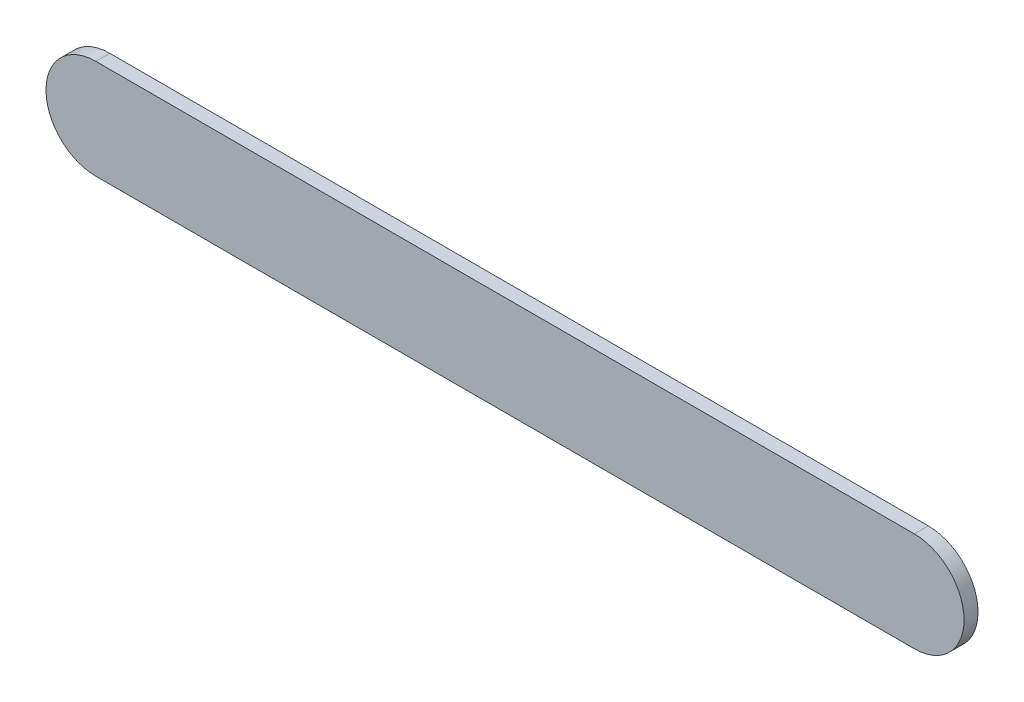
ISO-10303-21;
HEADER;
FILE_DESCRIPTION(('STEP AP214'),'2;1');
FILE_NAME('part.step','',(''),(''),'','','');
FILE_SCHEMA(('AUTOMOTIVE_DESIGN { 1 0 10303 214 1 1 1 1 }'));
ENDSEC;
DATA;
#1=APPLICATION_CONTEXT('core data for automotive mechanical design processes');
#2=APPLICATION_PROTOCOL_DEFINITION('international standard','automotive_design',2000,#1);
#3=PRODUCT_CONTEXT('',#1,'mechanical');
#4=PRODUCT('Part','Part','',(#3));
#5=PRODUCT_RELATED_PRODUCT_CATEGORY('part','',(#4));
#6=PRODUCT_DEFINITION_FORMATION('','',#4);
#7=PRODUCT_DEFINITION_CONTEXT('part definition',#1,'design');
#8=PRODUCT_DEFINITION('design','',#6,#7);
#9=PRODUCT_DEFINITION_SHAPE('','',#8);
#10=(LENGTH_UNIT() NAMED_UNIT(*) SI_UNIT(.MILLI.,.METRE.));
#11=(NAMED_UNIT(*) PLANE_ANGLE_UNIT() SI_UNIT($,.RADIAN.));
#12=(NAMED_UNIT(*) SI_UNIT($,.STERADIAN.) SOLID_ANGLE_UNIT());
#13=UNCERTAINTY_MEASURE_WITH_UNIT(LENGTH_MEASURE(1.E-05),#10,'distance_accuracy_value','');
#14=(GEOMETRIC_REPRESENTATION_CONTEXT(3) GLOBAL_UNCERTAINTY_ASSIGNED_CONTEXT((#13)) GLOBAL_UNIT_ASSIGNED_CONTEXT((#10,
#11,#12)) REPRESENTATION_CONTEXT('',''));
#15=CARTESIAN_POINT('',(0.,0.,0.));
#16=DIRECTION('',(0.,0.,1.));
#17=DIRECTION('',(1.,0.,0.));
#18=AXIS2_PLACEMENT_3D('',#15,#16,#17);
#19=CARTESIAN_POINT('',(93.417009,92.5599368,0.));
#20=DIRECTION('',(0.,1.,0.));
#21=DIRECTION('',(1.,0.,0.));
#22=AXIS2_PLACEMENT_3D('',#19,#20,#21);
#23=PLANE('',#22);
#24=DIRECTION('',(1.,0.,0.));
#25=VECTOR('',#24,1.);
#26=CARTESIAN_POINT('',(93.417009,92.5599368,0.03556));
#27=LINE('',#26,#25);
#28=CARTESIAN_POINT('',(93.417009,92.5599368,0.03556));
#29=VERTEX_POINT('',#28);
#30=CARTESIAN_POINT('',(95.5069464,92.5599368,0.03556));
#31=VERTEX_POINT('',#30);
#32=EDGE_CURVE('E11',#29,#31,#27,.T.);
#33=ORIENTED_EDGE('',*,*,#32,.F.);
#34=DIRECTION('',(0.,0.,1.));
#35=VECTOR('',#34,1.);
#36=CARTESIAN_POINT('',(93.417009,92.5599368,0.));
#37=LINE('',#36,#35);
#38=CARTESIAN_POINT('',(93.417009,92.5599368,0.));
#39=VERTEX_POINT('',#38);
#40=EDGE_CURVE('E24',#39,#29,#37,.T.);
#41=ORIENTED_EDGE('',*,*,#40,.F.);
#42=DIRECTION('',(1.,0.,0.));
#43=VECTOR('',#42,1.);
#44=CARTESIAN_POINT('',(93.417009,92.5599368,0.));
#45=LINE('',#44,#43);
#46=CARTESIAN_POINT('',(95.5069464,92.5599368,0.));
#47=VERTEX_POINT('',#46);
#48=EDGE_CURVE('E75',#39,#47,#45,.T.);
#49=ORIENTED_EDGE('',*,*,#48,.T.);
#50=DIRECTION('',(0.,0.,1.));
#51=VECTOR('',#50,1.);
#52=CARTESIAN_POINT('',(95.5069464,92.5599368,0.));
#53=LINE('',#52,#51);
#54=EDGE_CURVE('E37',#47,#31,#53,.T.);
#55=ORIENTED_EDGE('',*,*,#54,.T.);
#56=EDGE_LOOP('',(#33,#41,#49,#55));
#57=FACE_BOUND('',#56,.T.);
#58=ADVANCED_FACE('F17',(#57),#23,.F.);
#59=CARTESIAN_POINT('',(95.5069464,92.6869368,0.));
#60=DIRECTION('',(0.,0.,-1.));
#61=DIRECTION('',(1.1189649382048E-13,-1.,0.));
#62=AXIS2_PLACEMENT_3D('',#59,#60,#61);
#63=CYLINDRICAL_SURFACE('',#62,0.127000000000005);
#64=CARTESIAN_POINT('',(95.5069464,92.6869368,0.03556));
#65=DIRECTION('',(0.,0.,1.));
#66=DIRECTION('',(1.1189649382048E-13,-1.,0.));
#67=AXIS2_PLACEMENT_3D('',#64,#65,#66);
#68=CIRCLE('',#67,0.127000000000005);
#69=CARTESIAN_POINT('',(95.5069464,92.8139368,0.03556));
#70=VERTEX_POINT('',#69);
#71=EDGE_CURVE('E83',#31,#70,#68,.T.);
#72=ORIENTED_EDGE('',*,*,#71,.F.);
#73=ORIENTED_EDGE('',*,*,#54,.F.);
#74=CARTESIAN_POINT('',(95.5069464,92.6869368,0.));
#75=DIRECTION('',(0.,0.,1.));
#76=DIRECTION('',(1.1189649382048E-13,-1.,0.));
#77=AXIS2_PLACEMENT_3D('',#74,#75,#76);
#78=CIRCLE('',#77,0.127000000000005);
#79=CARTESIAN_POINT('',(95.5069464,92.8139368,0.));
#80=VERTEX_POINT('',#79);
#81=EDGE_CURVE('E81',#47,#80,#78,.T.);
#82=ORIENTED_EDGE('',*,*,#81,.T.);
#83=DIRECTION('',(0.,0.,1.));
#84=VECTOR('',#83,1.);
#85=CARTESIAN_POINT('',(95.5069464,92.8139368,0.));
#86=LINE('',#85,#84);
#87=EDGE_CURVE('E67',#80,#70,#86,.T.);
#88=ORIENTED_EDGE('',*,*,#87,.T.);
#89=EDGE_LOOP('',(#72,#73,#82,#88));
#90=FACE_BOUND('',#89,.T.);
#91=ADVANCED_FACE('F89',(#90),#63,.T.);
#92=CARTESIAN_POINT('',(95.5069464,92.8139368,0.));
#93=DIRECTION('',(0.,-1.,0.));
#94=DIRECTION('',(-1.,0.,0.));
#95=AXIS2_PLACEMENT_3D('',#92,#93,#94);
#96=PLANE('',#95);
#97=DIRECTION('',(-1.,0.,0.));
#98=VECTOR('',#97,1.);
#99=CARTESIAN_POINT('',(95.5069464,92.8139368,0.03556));
#100=LINE('',#99,#98);
#101=CARTESIAN_POINT('',(93.417009,92.8139368,0.03556));
#102=VERTEX_POINT('',#101);
#103=EDGE_CURVE('E71',#70,#102,#100,.T.);
#104=ORIENTED_EDGE('',*,*,#103,.F.);
#105=ORIENTED_EDGE('',*,*,#87,.F.);
#106=DIRECTION('',(-1.,0.,0.));
#107=VECTOR('',#106,1.);
#108=CARTESIAN_POINT('',(95.5069464,92.8139368,0.));
#109=LINE('',#108,#107);
#110=CARTESIAN_POINT('',(93.417009,92.8139368,0.));
#111=VERTEX_POINT('',#110);
#112=EDGE_CURVE('E63',#80,#111,#109,.T.);
#113=ORIENTED_EDGE('',*,*,#112,.T.);
#114=DIRECTION('',(0.,0.,1.));
#115=VECTOR('',#114,1.);
#116=CARTESIAN_POINT('',(93.417009,92.8139368,0.));
#117=LINE('',#116,#115);
#118=EDGE_CURVE('E53',#111,#102,#117,.T.);
#119=ORIENTED_EDGE('',*,*,#118,.T.);
#120=EDGE_LOOP('',(#104,#105,#113,#119));
#121=FACE_BOUND('',#120,.T.);
#122=ADVANCED_FACE('F66',(#121),#96,.F.);
#123=CARTESIAN_POINT('',(93.417009,92.6869368,0.));
#124=DIRECTION('',(0.,0.,-1.));
#125=DIRECTION('',(-1.11896493820492E-13,1.,0.));
#126=AXIS2_PLACEMENT_3D('',#123,#124,#125);
#127=CYLINDRICAL_SURFACE('',#126,0.127000000000005);
#128=CARTESIAN_POINT('',(93.417009,92.6869368,0.03556));
#129=DIRECTION('',(0.,0.,1.));
#130=DIRECTION('',(-1.11896493820492E-13,1.,0.));
#131=AXIS2_PLACEMENT_3D('',#128,#129,#130);
#132=CIRCLE('',#131,0.127000000000005);
#133=EDGE_CURVE('E59',#102,#29,#132,.T.);
#134=ORIENTED_EDGE('',*,*,#133,.F.);
#135=ORIENTED_EDGE('',*,*,#118,.F.);
#136=CARTESIAN_POINT('',(93.417009,92.6869368,0.));
#137=DIRECTION('',(0.,0.,1.));
#138=DIRECTION('',(-1.11896493820492E-13,1.,0.));
#139=AXIS2_PLACEMENT_3D('',#136,#137,#138);
#140=CIRCLE('',#139,0.127000000000005);
#141=EDGE_CURVE('E57',#111,#39,#140,.T.);
#142=ORIENTED_EDGE('',*,*,#141,.T.);
#143=ORIENTED_EDGE('',*,*,#40,.T.);
#144=EDGE_LOOP('',(#134,#135,#142,#143));
#145=FACE_BOUND('',#144,.T.);
#146=ADVANCED_FACE('F55',(#145),#127,.T.);
#147=CARTESIAN_POINT('',(93.417009,92.5599368,0.));
#148=DIRECTION('',(0.,0.,-1.));
#149=DIRECTION('',(-1.,0.,0.));
#150=AXIS2_PLACEMENT_3D('',#147,#148,#149);
#151=PLANE('',#150);
#152=ORIENTED_EDGE('',*,*,#141,.F.);
#153=ORIENTED_EDGE('',*,*,#112,.F.);
#154=ORIENTED_EDGE('',*,*,#81,.F.);
#155=ORIENTED_EDGE('',*,*,#48,.F.);
#156=EDGE_LOOP('',(#152,#153,#154,#155));
#157=FACE_BOUND('',#156,.T.);
#158=ADVANCED_FACE('F74',(#157),#151,.T.);
#159=CARTESIAN_POINT('',(93.417009,92.5599368,0.03556));
#160=DIRECTION('',(0.,0.,-1.));
#161=DIRECTION('',(-1.,0.,0.));
#162=AXIS2_PLACEMENT_3D('',#159,#160,#161);
#163=PLANE('',#162);
#164=ORIENTED_EDGE('',*,*,#32,.T.);
#165=ORIENTED_EDGE('',*,*,#71,.T.);
#166=ORIENTED_EDGE('',*,*,#103,.T.);
#167=ORIENTED_EDGE('',*,*,#133,.T.);
#168=EDGE_LOOP('',(#164,#165,#166,#167));
#169=FACE_BOUND('',#168,.T.);
#170=ADVANCED_FACE('F91',(#169),#163,.F.);
#171=CLOSED_SHELL('',(#58,#91,#122,#146,#158,#170));
#172=MANIFOLD_SOLID_BREP('B1',#171);
#173=ADVANCED_BREP_SHAPE_REPRESENTATION('',(#18,#172),#14);
#174=SHAPE_DEFINITION_REPRESENTATION(#9,#173);
ENDSEC;
END-ISO-10303-21;
